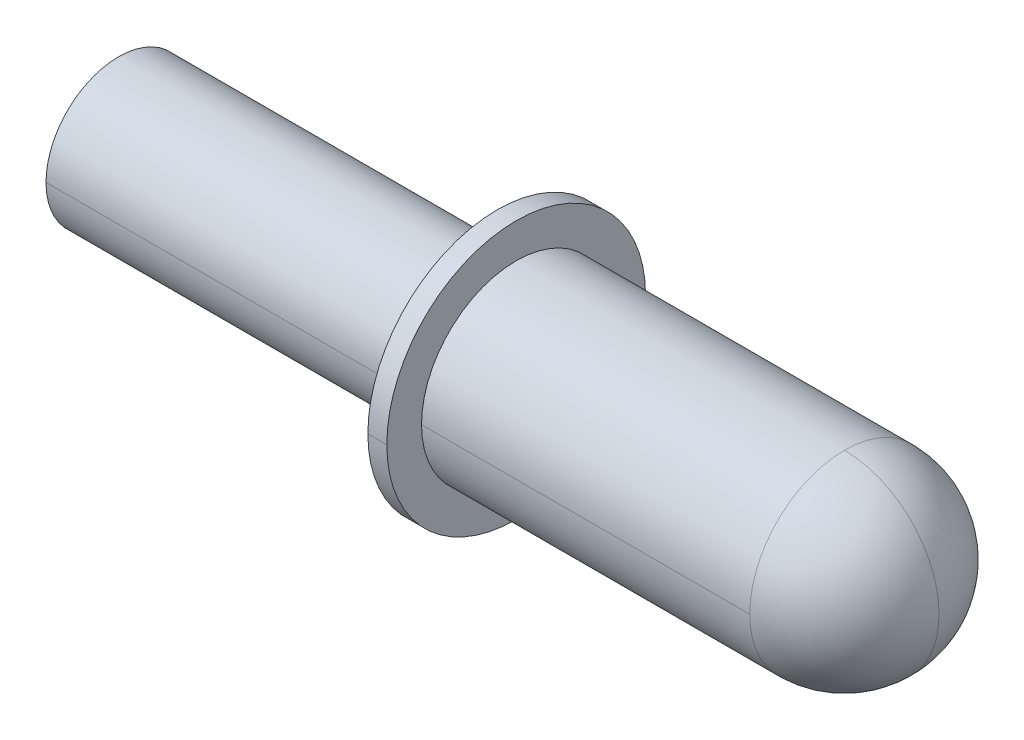
ISO-10303-21;
HEADER;
FILE_DESCRIPTION(('STEP AP214'),'2;1');
FILE_NAME('part.step','',(''),(''),'','','');
FILE_SCHEMA(('AUTOMOTIVE_DESIGN { 1 0 10303 214 1 1 1 1 }'));
ENDSEC;
DATA;
#1=APPLICATION_CONTEXT('core data for automotive mechanical design processes');
#2=APPLICATION_PROTOCOL_DEFINITION('international standard','automotive_design',2000,#1);
#3=PRODUCT_CONTEXT('',#1,'mechanical');
#4=PRODUCT('Part','Part','',(#3));
#5=PRODUCT_RELATED_PRODUCT_CATEGORY('part','',(#4));
#6=PRODUCT_DEFINITION_FORMATION('','',#4);
#7=PRODUCT_DEFINITION_CONTEXT('part definition',#1,'design');
#8=PRODUCT_DEFINITION('design','',#6,#7);
#9=PRODUCT_DEFINITION_SHAPE('','',#8);
#10=(LENGTH_UNIT() NAMED_UNIT(*) SI_UNIT(.MILLI.,.METRE.));
#11=(NAMED_UNIT(*) PLANE_ANGLE_UNIT() SI_UNIT($,.RADIAN.));
#12=(NAMED_UNIT(*) SI_UNIT($,.STERADIAN.) SOLID_ANGLE_UNIT());
#13=UNCERTAINTY_MEASURE_WITH_UNIT(LENGTH_MEASURE(1.E-05),#10,'distance_accuracy_value','');
#14=(GEOMETRIC_REPRESENTATION_CONTEXT(3) GLOBAL_UNCERTAINTY_ASSIGNED_CONTEXT((#13)) GLOBAL_UNIT_ASSIGNED_CONTEXT((#10,
#11,#12)) REPRESENTATION_CONTEXT('',''));
#15=CARTESIAN_POINT('',(0.,0.,0.));
#16=DIRECTION('',(0.,0.,1.));
#17=DIRECTION('',(1.,0.,0.));
#18=AXIS2_PLACEMENT_3D('',#15,#16,#17);
#19=CARTESIAN_POINT('',(0.3,0.,0.));
#20=DIRECTION('',(-1.,0.,0.));
#21=DIRECTION('',(0.,-1.,0.));
#22=AXIS2_PLACEMENT_3D('',#19,#20,#21);
#23=CYLINDRICAL_SURFACE('',#22,2.05);
#24=CARTESIAN_POINT('',(0.3,0.,0.));
#25=DIRECTION('',(1.,0.,0.));
#26=DIRECTION('',(0.,0.,-1.));
#27=AXIS2_PLACEMENT_3D('',#24,#25,#26);
#28=CIRCLE('',#27,2.05);
#29=CARTESIAN_POINT('',(0.3,0.,-2.05));
#30=VERTEX_POINT('',#29);
#31=CARTESIAN_POINT('',(0.3,0.,2.05));
#32=VERTEX_POINT('',#31);
#33=EDGE_CURVE('E11',#30,#32,#28,.T.);
#34=ORIENTED_EDGE('',*,*,#33,.F.);
#35=DIRECTION('',(-1.,0.,0.));
#36=VECTOR('',#35,1.);
#37=CARTESIAN_POINT('',(0.3,0.,-2.05));
#38=LINE('',#37,#36);
#39=CARTESIAN_POINT('',(0.,0.,-2.05));
#40=VERTEX_POINT('',#39);
#41=EDGE_CURVE('E25',#30,#40,#38,.T.);
#42=ORIENTED_EDGE('',*,*,#41,.T.);
#43=CARTESIAN_POINT('',(0.,0.,0.));
#44=DIRECTION('',(1.,0.,0.));
#45=DIRECTION('',(0.,0.,-1.));
#46=AXIS2_PLACEMENT_3D('',#43,#44,#45);
#47=CIRCLE('',#46,2.05);
#48=CARTESIAN_POINT('',(0.,0.,2.05));
#49=VERTEX_POINT('',#48);
#50=EDGE_CURVE('E292',#40,#49,#47,.T.);
#51=ORIENTED_EDGE('',*,*,#50,.T.);
#52=DIRECTION('',(-1.,0.,0.));
#53=VECTOR('',#52,1.);
#54=CARTESIAN_POINT('',(0.3,0.,2.05));
#55=LINE('',#54,#53);
#56=EDGE_CURVE('E287',#32,#49,#55,.T.);
#57=ORIENTED_EDGE('',*,*,#56,.F.);
#58=EDGE_LOOP('',(#34,#42,#51,#57));
#59=FACE_BOUND('',#58,.T.);
#60=ADVANCED_FACE('F17',(#59),#23,.T.);
#61=CARTESIAN_POINT('',(0.3,0.,0.));
#62=DIRECTION('',(-1.,0.,0.));
#63=DIRECTION('',(0.,1.,0.));
#64=AXIS2_PLACEMENT_3D('',#61,#62,#63);
#65=CYLINDRICAL_SURFACE('',#64,2.05);
#66=CARTESIAN_POINT('',(0.,0.,0.));
#67=DIRECTION('',(1.,0.,0.));
#68=DIRECTION('',(0.,0.,-1.));
#69=AXIS2_PLACEMENT_3D('',#66,#67,#68);
#70=CIRCLE('',#69,2.05);
#71=EDGE_CURVE('E283',#49,#40,#70,.T.);
#72=ORIENTED_EDGE('',*,*,#71,.T.);
#73=ORIENTED_EDGE('',*,*,#41,.F.);
#74=CARTESIAN_POINT('',(0.3,0.,0.));
#75=DIRECTION('',(1.,0.,0.));
#76=DIRECTION('',(0.,0.,-1.));
#77=AXIS2_PLACEMENT_3D('',#74,#75,#76);
#78=CIRCLE('',#77,2.05);
#79=EDGE_CURVE('E278',#32,#30,#78,.T.);
#80=ORIENTED_EDGE('',*,*,#79,.F.);
#81=ORIENTED_EDGE('',*,*,#56,.T.);
#82=EDGE_LOOP('',(#72,#73,#80,#81));
#83=FACE_BOUND('',#82,.T.);
#84=ADVANCED_FACE('F305',(#83),#65,.T.);
#85=CARTESIAN_POINT('',(0.3,2.05,0.));
#86=DIRECTION('',(-1.,0.,0.));
#87=DIRECTION('',(0.,0.,1.));
#88=AXIS2_PLACEMENT_3D('',#85,#86,#87);
#89=PLANE('',#88);
#90=CARTESIAN_POINT('',(0.3,0.,0.));
#91=DIRECTION('',(-1.,0.,0.));
#92=DIRECTION('',(0.,0.,1.));
#93=AXIS2_PLACEMENT_3D('',#90,#91,#92);
#94=CIRCLE('',#93,1.5);
#95=CARTESIAN_POINT('',(0.3,0.,1.5));
#96=VERTEX_POINT('',#95);
#97=CARTESIAN_POINT('',(0.3,0.,-1.5));
#98=VERTEX_POINT('',#97);
#99=EDGE_CURVE('E274',#96,#98,#94,.T.);
#100=ORIENTED_EDGE('',*,*,#99,.T.);
#101=CARTESIAN_POINT('',(0.3,0.,0.));
#102=DIRECTION('',(-1.,0.,0.));
#103=DIRECTION('',(0.,0.,1.));
#104=AXIS2_PLACEMENT_3D('',#101,#102,#103);
#105=CIRCLE('',#104,1.5);
#106=EDGE_CURVE('E270',#98,#96,#105,.T.);
#107=ORIENTED_EDGE('',*,*,#106,.T.);
#108=EDGE_LOOP('',(#100,#107));
#109=FACE_BOUND('',#108,.T.);
#110=ORIENTED_EDGE('',*,*,#33,.T.);
#111=ORIENTED_EDGE('',*,*,#79,.T.);
#112=EDGE_LOOP('',(#110,#111));
#113=FACE_BOUND('',#112,.T.);
#114=ADVANCED_FACE('F347',(#109,#113),#89,.F.);
#115=CARTESIAN_POINT('',(7.,0.,0.));
#116=DIRECTION('',(-1.,0.,0.));
#117=DIRECTION('',(0.,1.,0.));
#118=AXIS2_PLACEMENT_3D('',#115,#116,#117);
#119=CYLINDRICAL_SURFACE('',#118,1.5);
#120=ORIENTED_EDGE('',*,*,#106,.F.);
#121=DIRECTION('',(-1.,0.,0.));
#122=VECTOR('',#121,1.);
#123=CARTESIAN_POINT('',(5.5,0.,-1.5));
#124=LINE('',#123,#122);
#125=CARTESIAN_POINT('',(5.5,0.,-1.5));
#126=VERTEX_POINT('',#125);
#127=EDGE_CURVE('E265',#126,#98,#124,.T.);
#128=ORIENTED_EDGE('',*,*,#127,.F.);
#129=CARTESIAN_POINT('',(5.5,0.,0.));
#130=DIRECTION('',(1.,0.,0.));
#131=DIRECTION('',(0.,0.,-1.));
#132=AXIS2_PLACEMENT_3D('',#129,#130,#131);
#133=CIRCLE('',#132,1.5);
#134=CARTESIAN_POINT('',(5.5,-1.50000000000007,0.));
#135=VERTEX_POINT('',#134);
#136=EDGE_CURVE('E261',#135,#126,#133,.T.);
#137=ORIENTED_EDGE('',*,*,#136,.F.);
#138=CARTESIAN_POINT('',(5.5,0.,0.));
#139=DIRECTION('',(1.,0.,0.));
#140=DIRECTION('',(0.,0.,-1.));
#141=AXIS2_PLACEMENT_3D('',#138,#139,#140);
#142=CIRCLE('',#141,1.5);
#143=CARTESIAN_POINT('',(5.5,0.,1.5));
#144=VERTEX_POINT('',#143);
#145=EDGE_CURVE('E257',#144,#135,#142,.T.);
#146=ORIENTED_EDGE('',*,*,#145,.F.);
#147=DIRECTION('',(-1.,0.,0.));
#148=VECTOR('',#147,1.);
#149=CARTESIAN_POINT('',(5.5,0.,1.5));
#150=LINE('',#149,#148);
#151=EDGE_CURVE('E252',#144,#96,#150,.T.);
#152=ORIENTED_EDGE('',*,*,#151,.T.);
#153=EDGE_LOOP('',(#120,#128,#137,#146,#152));
#154=FACE_BOUND('',#153,.T.);
#155=ADVANCED_FACE('F351',(#154),#119,.T.);
#156=CARTESIAN_POINT('',(7.,0.,0.));
#157=DIRECTION('',(-1.,0.,0.));
#158=DIRECTION('',(0.,-1.,0.));
#159=AXIS2_PLACEMENT_3D('',#156,#157,#158);
#160=CYLINDRICAL_SURFACE('',#159,1.5);
#161=CARTESIAN_POINT('',(5.5,0.,0.));
#162=DIRECTION('',(1.,0.,0.));
#163=DIRECTION('',(0.,0.,-1.));
#164=AXIS2_PLACEMENT_3D('',#161,#162,#163);
#165=CIRCLE('',#164,1.5);
#166=CARTESIAN_POINT('',(5.5,1.49999999999993,0.));
#167=VERTEX_POINT('',#166);
#168=EDGE_CURVE('E248',#167,#144,#165,.T.);
#169=ORIENTED_EDGE('',*,*,#168,.F.);
#170=CARTESIAN_POINT('',(5.5,0.,0.));
#171=DIRECTION('',(1.,0.,0.));
#172=DIRECTION('',(0.,0.,-1.));
#173=AXIS2_PLACEMENT_3D('',#170,#171,#172);
#174=CIRCLE('',#173,1.5);
#175=EDGE_CURVE('E246',#126,#167,#174,.T.);
#176=ORIENTED_EDGE('',*,*,#175,.F.);
#177=ORIENTED_EDGE('',*,*,#127,.T.);
#178=ORIENTED_EDGE('',*,*,#99,.F.);
#179=ORIENTED_EDGE('',*,*,#151,.F.);
#180=EDGE_LOOP('',(#169,#176,#177,#178,#179));
#181=FACE_BOUND('',#180,.T.);
#182=ADVANCED_FACE('F356',(#181),#160,.T.);
#183=CARTESIAN_POINT('',(5.49999999999993,0.,0.));
#184=DIRECTION('',(1.,0.,0.));
#185=DIRECTION('',(0.,0.,1.));
#186=AXIS2_PLACEMENT_3D('',#183,#184,#185);
#187=SPHERICAL_SURFACE('',#186,1.5);
#188=CARTESIAN_POINT('',(5.5,-1.50000000000007,0.));
#189=CARTESIAN_POINT('',(5.52454371739133,-1.50000052063323,0.));
#190=CARTESIAN_POINT('',(5.54908739048189,-1.4993976256878,0.));
#191=CARTESIAN_POINT('',(5.59811563250036,-1.49698874292786,0.));
#192=CARTESIAN_POINT('',(5.62260020142827,-1.49518275511335,0.));
#193=CARTESIAN_POINT('',(5.67145121956039,-1.49037142490338,0.));
#194=CARTESIAN_POINT('',(5.69581766876459,-1.48736608250791,0.));
#195=CARTESIAN_POINT('',(5.74437375460147,-1.48016344738656,0.));
#196=CARTESIAN_POINT('',(5.76856339123415,-1.47596615466067,0.));
#197=CARTESIAN_POINT('',(5.81670757481421,-1.46638968654914,0.));
#198=CARTESIAN_POINT('',(5.84066212176159,-1.4610105111635,0.));
#199=CARTESIAN_POINT('',(5.88827841794817,-1.44908324842025,0.));
#200=CARTESIAN_POINT('',(5.91194016718736,-1.44253516106262,0.));
#201=CARTESIAN_POINT('',(5.95891386457599,-1.42828584613412,0.));
#202=CARTESIAN_POINT('',(5.98222581272544,-1.42058461856323,0.));
#203=CARTESIAN_POINT('',(6.02844374745118,-1.40404757698594,0.));
#204=CARTESIAN_POINT('',(6.05134973402746,-1.39521176297955,0.));
#205=CARTESIAN_POINT('',(6.09670056306776,-1.37642683455442,0.));
#206=CARTESIAN_POINT('',(6.11914540553176,-1.3664777201357,0.));
#207=CARTESIAN_POINT('',(6.16351987475903,-1.34549015923474,0.));
#208=CARTESIAN_POINT('',(6.1854495015223,-1.3344517127525,0.));
#209=CARTESIAN_POINT('',(6.22874070895563,-1.31131208029267,0.));
#210=CARTESIAN_POINT('',(6.25010228962569,-1.29921089431507,0.));
#211=CARTESIAN_POINT('',(6.29220594295391,-1.27397493568584,0.));
#212=CARTESIAN_POINT('',(6.31294801561208,-1.26084016303421,0.));
#213=CARTESIAN_POINT('',(6.35376268344665,-1.23356867387353,0.));
#214=CARTESIAN_POINT('',(6.37383527862305,-1.21943195736447,0.));
#215=CARTESIAN_POINT('',(6.41326263485417,-1.19019063707756,0.));
#216=CARTESIAN_POINT('',(6.43261739590888,-1.1750860332997,0.));
#217=CARTESIAN_POINT('',(6.47056245658197,-1.14394532678861,0.));
#218=CARTESIAN_POINT('',(6.48915275620034,-1.12790922405537,0.));
#219=CARTESIAN_POINT('',(6.52552410834063,-1.09494415200961,0.));
#220=CARTESIAN_POINT('',(6.54330516086255,-1.07801518269709,0.));
#221=CARTESIAN_POINT('',(6.57801518269699,-1.04330516086265,0.));
#222=CARTESIAN_POINT('',(6.59494415200951,-1.02552410834073,0.));
#223=CARTESIAN_POINT('',(6.62790922405527,-0.989152756200432,0.));
#224=CARTESIAN_POINT('',(6.6439453267885,-0.970562456582063,0.));
#225=CARTESIAN_POINT('',(6.6750860332996,-0.932617395908978,0.));
#226=CARTESIAN_POINT('',(6.69019063707746,-0.913262634854262,0.));
#227=CARTESIAN_POINT('',(6.71943195736437,-0.873835278623144,0.));
#228=CARTESIAN_POINT('',(6.73356867387342,-0.853762683446743,0.));
#229=CARTESIAN_POINT('',(6.7608401630341,-0.812948015612172,0.));
#230=CARTESIAN_POINT('',(6.77397493568574,-0.792205942954001,0.));
#231=CARTESIAN_POINT('',(6.79921089431496,-0.750102289625774,0.));
#232=CARTESIAN_POINT('',(6.81131208029256,-0.728740708955717,0.));
#233=CARTESIAN_POINT('',(6.83445171275239,-0.685449501522389,0.));
#234=CARTESIAN_POINT('',(6.84549015923462,-0.663519874759119,0.));
#235=CARTESIAN_POINT('',(6.86647772013558,-0.619145405531844,0.));
#236=CARTESIAN_POINT('',(6.87642683455431,-0.596700563067841,0.));
#237=CARTESIAN_POINT('',(6.89521176297943,-0.551349734027549,0.));
#238=CARTESIAN_POINT('',(6.90404757698582,-0.52844374745126,0.));
#239=CARTESIAN_POINT('',(6.92058461856311,-0.482225812725524,0.));
#240=CARTESIAN_POINT('',(6.92828584613399,-0.458913864576076,0.));
#241=CARTESIAN_POINT('',(6.9425351610625,-0.411940167187439,0.));
#242=CARTESIAN_POINT('',(6.94908324842012,-0.388278417948249,0.));
#243=CARTESIAN_POINT('',(6.96101051116338,-0.340662121761675,0.));
#244=CARTESIAN_POINT('',(6.96638968654901,-0.316707574814291,0.));
#245=CARTESIAN_POINT('',(6.97596615466054,-0.26856339123423,0.));
#246=CARTESIAN_POINT('',(6.98016344738643,-0.244373754601552,0.));
#247=CARTESIAN_POINT('',(6.98736608250778,-0.195817668764674,0.));
#248=CARTESIAN_POINT('',(6.99037142490324,-0.171451219560472,0.));
#249=CARTESIAN_POINT('',(6.99518275511321,-0.122600201428354,0.));
#250=CARTESIAN_POINT('',(6.99698874292772,-0.0981156325004374,0.));
#251=CARTESIAN_POINT('',(6.99939762568766,-0.049087390481966,0.));
#252=CARTESIAN_POINT('',(7.00000052063309,-0.0245437173914114,0.));
#253=CARTESIAN_POINT('',(6.99999999999993,0.,0.));
#254=B_SPLINE_CURVE_WITH_KNOTS('',3,(#188,#189,#190,#191,#192,#193,#194,#195,#196,#197,#198,
#199,#200,#201,#202,#203,#204,#205,#206,#207,#208,#209,#210,#211,#212,#213,#214,#215,#216,#217,
#218,#219,#220,#221,#222,#223,#224,#225,#226,#227,#228,#229,#230,#231,#232,#233,#234,#235,#236,
#237,#238,#239,#240,#241,#242,#243,#244,#245,#246,#247,#248,#249,#250,#251,#252,#253),
.UNSPECIFIED.,.F.,.F.,(4,2,2,2,2,2,2,2,2,2,2,2,2,2,2,2,2,2,2,2,2,2,2,2,2,2,2,2,2,2,2,2,4),(0.,
0.0736236855687349,0.14724737113747,0.220871056706204,0.294494742274939,0.368118427843673,
0.441742113412407,0.515365798981142,0.588989484549877,0.662613170118611,0.736236855687347,
0.809860541256081,0.883484226824816,0.957107912393551,1.03073159796228,1.10435528353102,
1.17797896909975,1.25160265466849,1.32522634023722,1.39885002580596,1.47247371137469,
1.54609739694343,1.61972108251216,1.6933447680809,1.76696845364963,1.84059213921837,
1.9142158247871,1.98783951035584,2.06146319592457,2.1350868814933,2.20871056706204,
2.28233425263077,2.35595793819951),.UNSPECIFIED.);
#255=CARTESIAN_POINT('',(6.99999999999993,0.,0.));
#256=VERTEX_POINT('',#255);
#257=EDGE_CURVE('E244',#135,#256,#254,.T.);
#258=ORIENTED_EDGE('',*,*,#257,.F.);
#259=ORIENTED_EDGE('',*,*,#136,.T.);
#260=ORIENTED_EDGE('',*,*,#175,.T.);
#261=CARTESIAN_POINT('',(5.5,1.49999999999993,0.));
#262=CARTESIAN_POINT('',(5.52454371739133,1.50000052063309,0.));
#263=CARTESIAN_POINT('',(5.54908739048189,1.49939762568765,0.));
#264=CARTESIAN_POINT('',(5.59811563250036,1.49698874292771,0.));
#265=CARTESIAN_POINT('',(5.62260020142827,1.4951827551132,0.));
#266=CARTESIAN_POINT('',(5.67145121956039,1.49037142490323,0.));
#267=CARTESIAN_POINT('',(5.69581766876459,1.48736608250777,0.));
#268=CARTESIAN_POINT('',(5.74437375460147,1.48016344738641,0.));
#269=CARTESIAN_POINT('',(5.76856339123415,1.47596615466052,0.));
#270=CARTESIAN_POINT('',(5.81670757481421,1.466389686549,0.));
#271=CARTESIAN_POINT('',(5.84066212176159,1.46101051116336,0.));
#272=CARTESIAN_POINT('',(5.88827841794817,1.4490832484201,0.));
#273=CARTESIAN_POINT('',(5.91194016718736,1.44253516106248,0.));
#274=CARTESIAN_POINT('',(5.95891386457599,1.42828584613397,0.));
#275=CARTESIAN_POINT('',(5.98222581272544,1.42058461856308,0.));
#276=CARTESIAN_POINT('',(6.02844374745117,1.4040475769858,0.));
#277=CARTESIAN_POINT('',(6.05134973402746,1.3952117629794,0.));
#278=CARTESIAN_POINT('',(6.09670056306775,1.37642683455428,0.));
#279=CARTESIAN_POINT('',(6.11914540553176,1.36647772013555,0.));
#280=CARTESIAN_POINT('',(6.16351987475903,1.34549015923459,0.));
#281=CARTESIAN_POINT('',(6.1854495015223,1.33445171275235,0.));
#282=CARTESIAN_POINT('',(6.22874070895563,1.31131208029252,0.));
#283=CARTESIAN_POINT('',(6.25010228962569,1.29921089431493,0.));
#284=CARTESIAN_POINT('',(6.29220594295391,1.2739749356857,0.));
#285=CARTESIAN_POINT('',(6.31294801561208,1.26084016303407,0.));
#286=CARTESIAN_POINT('',(6.35376268344665,1.23356867387338,0.));
#287=CARTESIAN_POINT('',(6.37383527862305,1.21943195736433,0.));
#288=CARTESIAN_POINT('',(6.41326263485417,1.19019063707742,0.));
#289=CARTESIAN_POINT('',(6.43261739590888,1.17508603329956,0.));
#290=CARTESIAN_POINT('',(6.47056245658197,1.14394532678846,0.));
#291=CARTESIAN_POINT('',(6.48915275620034,1.12790922405522,0.));
#292=CARTESIAN_POINT('',(6.52552410834063,1.09494415200947,0.));
#293=CARTESIAN_POINT('',(6.54330516086255,1.07801518269695,0.));
#294=CARTESIAN_POINT('',(6.57801518269699,1.04330516086251,0.));
#295=CARTESIAN_POINT('',(6.59494415200951,1.02552410834058,0.));
#296=CARTESIAN_POINT('',(6.62790922405526,0.989152756200287,0.));
#297=CARTESIAN_POINT('',(6.6439453267885,0.970562456581918,0.));
#298=CARTESIAN_POINT('',(6.6750860332996,0.932617395908833,0.));
#299=CARTESIAN_POINT('',(6.69019063707746,0.913262634854117,0.));
#300=CARTESIAN_POINT('',(6.71943195736437,0.873835278622999,0.));
#301=CARTESIAN_POINT('',(6.73356867387342,0.853762683446598,0.));
#302=CARTESIAN_POINT('',(6.7608401630341,0.812948015612027,0.));
#303=CARTESIAN_POINT('',(6.77397493568573,0.792205942953856,0.));
#304=CARTESIAN_POINT('',(6.79921089431496,0.750102289625629,0.));
#305=CARTESIAN_POINT('',(6.81131208029256,0.728740708955572,0.));
#306=CARTESIAN_POINT('',(6.83445171275238,0.685449501522245,0.));
#307=CARTESIAN_POINT('',(6.84549015923462,0.663519874758974,0.));
#308=CARTESIAN_POINT('',(6.86647772013558,0.6191454055317,0.));
#309=CARTESIAN_POINT('',(6.87642683455431,0.596700563067696,0.));
#310=CARTESIAN_POINT('',(6.89521176297943,0.551349734027404,0.));
#311=CARTESIAN_POINT('',(6.90404757698582,0.528443747451115,0.));
#312=CARTESIAN_POINT('',(6.92058461856311,0.482225812725379,0.));
#313=CARTESIAN_POINT('',(6.92828584613399,0.458913864575932,0.));
#314=CARTESIAN_POINT('',(6.9425351610625,0.411940167187294,0.));
#315=CARTESIAN_POINT('',(6.94908324842012,0.388278417948104,0.));
#316=CARTESIAN_POINT('',(6.96101051116338,0.34066212176153,0.));
#317=CARTESIAN_POINT('',(6.96638968654901,0.316707574814146,0.));
#318=CARTESIAN_POINT('',(6.97596615466054,0.268563391234085,0.));
#319=CARTESIAN_POINT('',(6.98016344738643,0.244373754601407,0.));
#320=CARTESIAN_POINT('',(6.98736608250778,0.195817668764529,0.));
#321=CARTESIAN_POINT('',(6.99037142490324,0.171451219560328,0.));
#322=CARTESIAN_POINT('',(6.99518275511321,0.12260020142821,0.));
#323=CARTESIAN_POINT('',(6.99698874292772,0.0981156325002929,0.));
#324=CARTESIAN_POINT('',(6.99939762568766,0.0490873904818212,0.));
#325=CARTESIAN_POINT('',(7.00000052063309,0.0245437173912666,0.));
#326=CARTESIAN_POINT('',(6.99999999999993,0.,0.));
#327=B_SPLINE_CURVE_WITH_KNOTS('',3,(#261,#262,#263,#264,#265,#266,#267,#268,#269,#270,#271,
#272,#273,#274,#275,#276,#277,#278,#279,#280,#281,#282,#283,#284,#285,#286,#287,#288,#289,#290,
#291,#292,#293,#294,#295,#296,#297,#298,#299,#300,#301,#302,#303,#304,#305,#306,#307,#308,#309,
#310,#311,#312,#313,#314,#315,#316,#317,#318,#319,#320,#321,#322,#323,#324,#325,#326),
.UNSPECIFIED.,.F.,.F.,(4,2,2,2,2,2,2,2,2,2,2,2,2,2,2,2,2,2,2,2,2,2,2,2,2,2,2,2,2,2,2,2,4),(0.,
0.0736236855687341,0.147247371137469,0.220871056706204,0.294494742274938,0.368118427843673,
0.441742113412407,0.515365798981142,0.588989484549877,0.662613170118611,0.736236855687346,
0.809860541256081,0.883484226824816,0.95710791239355,1.03073159796228,1.10435528353102,
1.17797896909975,1.25160265466849,1.32522634023722,1.39885002580596,1.47247371137469,
1.54609739694343,1.61972108251216,1.6933447680809,1.76696845364963,1.84059213921837,
1.9142158247871,1.98783951035583,2.06146319592457,2.1350868814933,2.20871056706204,
2.28233425263077,2.35595793819951),.UNSPECIFIED.);
#328=EDGE_CURVE('E185',#167,#256,#327,.T.);
#329=ORIENTED_EDGE('',*,*,#328,.T.);
#330=EDGE_LOOP('',(#258,#259,#260,#329));
#331=FACE_BOUND('',#330,.T.);
#332=ADVANCED_FACE('F205',(#331),#187,.T.);
#333=CARTESIAN_POINT('',(5.49999999999993,0.,0.));
#334=DIRECTION('',(1.,0.,0.));
#335=DIRECTION('',(0.,0.,-1.));
#336=AXIS2_PLACEMENT_3D('',#333,#334,#335);
#337=SPHERICAL_SURFACE('',#336,1.5);
#338=ORIENTED_EDGE('',*,*,#328,.F.);
#339=ORIENTED_EDGE('',*,*,#168,.T.);
#340=ORIENTED_EDGE('',*,*,#145,.T.);
#341=ORIENTED_EDGE('',*,*,#257,.T.);
#342=EDGE_LOOP('',(#338,#339,#340,#341));
#343=FACE_BOUND('',#342,.T.);
#344=ADVANCED_FACE('F194',(#343),#337,.T.);
#345=CARTESIAN_POINT('',(0.,1.15,0.));
#346=DIRECTION('',(1.,0.,0.));
#347=DIRECTION('',(0.,0.,-1.));
#348=AXIS2_PLACEMENT_3D('',#345,#346,#347);
#349=PLANE('',#348);
#350=ORIENTED_EDGE('',*,*,#50,.F.);
#351=ORIENTED_EDGE('',*,*,#71,.F.);
#352=EDGE_LOOP('',(#350,#351));
#353=FACE_BOUND('',#352,.T.);
#354=CARTESIAN_POINT('',(0.,0.,0.));
#355=DIRECTION('',(1.,0.,0.));
#356=DIRECTION('',(0.,0.,-1.));
#357=AXIS2_PLACEMENT_3D('',#354,#355,#356);
#358=CIRCLE('',#357,1.15);
#359=CARTESIAN_POINT('',(0.,0.,-1.15));
#360=VERTEX_POINT('',#359);
#361=CARTESIAN_POINT('',(0.,0.,1.15));
#362=VERTEX_POINT('',#361);
#363=EDGE_CURVE('E181',#360,#362,#358,.T.);
#364=ORIENTED_EDGE('',*,*,#363,.T.);
#365=CARTESIAN_POINT('',(0.,0.,0.));
#366=DIRECTION('',(1.,0.,0.));
#367=DIRECTION('',(0.,0.,-1.));
#368=AXIS2_PLACEMENT_3D('',#365,#366,#367);
#369=CIRCLE('',#368,1.15);
#370=EDGE_CURVE('E177',#362,#360,#369,.T.);
#371=ORIENTED_EDGE('',*,*,#370,.T.);
#372=EDGE_LOOP('',(#364,#371));
#373=FACE_BOUND('',#372,.T.);
#374=ADVANCED_FACE('F204',(#353,#373),#349,.F.);
#375=CARTESIAN_POINT('',(7.,0.,0.));
#376=DIRECTION('',(-1.,0.,0.));
#377=DIRECTION('',(0.,1.,0.));
#378=AXIS2_PLACEMENT_3D('',#375,#376,#377);
#379=CYLINDRICAL_SURFACE('',#378,1.15);
#380=CARTESIAN_POINT('',(-6.,0.,0.));
#381=DIRECTION('',(1.,0.,0.));
#382=DIRECTION('',(0.,0.,-1.));
#383=AXIS2_PLACEMENT_3D('',#380,#381,#382);
#384=CIRCLE('',#383,1.15);
#385=CARTESIAN_POINT('',(-6.,0.,1.15));
#386=VERTEX_POINT('',#385);
#387=CARTESIAN_POINT('',(-6.,0.,-1.15));
#388=VERTEX_POINT('',#387);
#389=EDGE_CURVE('E173',#386,#388,#384,.T.);
#390=ORIENTED_EDGE('',*,*,#389,.T.);
#391=DIRECTION('',(-1.,0.,0.));
#392=VECTOR('',#391,1.);
#393=CARTESIAN_POINT('',(0.,0.,-1.15));
#394=LINE('',#393,#392);
#395=EDGE_CURVE('E168',#360,#388,#394,.T.);
#396=ORIENTED_EDGE('',*,*,#395,.F.);
#397=ORIENTED_EDGE('',*,*,#370,.F.);
#398=DIRECTION('',(-1.,0.,0.));
#399=VECTOR('',#398,1.);
#400=CARTESIAN_POINT('',(0.,0.,1.15));
#401=LINE('',#400,#399);
#402=EDGE_CURVE('E164',#362,#386,#401,.T.);
#403=ORIENTED_EDGE('',*,*,#402,.T.);
#404=EDGE_LOOP('',(#390,#396,#397,#403));
#405=FACE_BOUND('',#404,.T.);
#406=ADVANCED_FACE('F308',(#405),#379,.T.);
#407=CARTESIAN_POINT('',(7.,0.,0.));
#408=DIRECTION('',(-1.,0.,0.));
#409=DIRECTION('',(0.,-1.,0.));
#410=AXIS2_PLACEMENT_3D('',#407,#408,#409);
#411=CYLINDRICAL_SURFACE('',#410,1.15);
#412=ORIENTED_EDGE('',*,*,#363,.F.);
#413=ORIENTED_EDGE('',*,*,#395,.T.);
#414=CARTESIAN_POINT('',(-6.,0.,0.));
#415=DIRECTION('',(1.,0.,0.));
#416=DIRECTION('',(0.,0.,-1.));
#417=AXIS2_PLACEMENT_3D('',#414,#415,#416);
#418=CIRCLE('',#417,1.15);
#419=EDGE_CURVE('E159',#388,#386,#418,.T.);
#420=ORIENTED_EDGE('',*,*,#419,.T.);
#421=ORIENTED_EDGE('',*,*,#402,.F.);
#422=EDGE_LOOP('',(#412,#413,#420,#421));
#423=FACE_BOUND('',#422,.T.);
#424=ADVANCED_FACE('F315',(#423),#411,.T.);
#425=CARTESIAN_POINT('',(-6.,0.85,0.));
#426=DIRECTION('',(1.,0.,0.));
#427=DIRECTION('',(0.,0.,-1.));
#428=AXIS2_PLACEMENT_3D('',#425,#426,#427);
#429=PLANE('',#428);
#430=ORIENTED_EDGE('',*,*,#419,.F.);
#431=ORIENTED_EDGE('',*,*,#389,.F.);
#432=EDGE_LOOP('',(#430,#431));
#433=FACE_BOUND('',#432,.T.);
#434=CARTESIAN_POINT('',(-6.,0.,0.));
#435=DIRECTION('',(1.,0.,0.));
#436=DIRECTION('',(0.,0.,-1.));
#437=AXIS2_PLACEMENT_3D('',#434,#435,#436);
#438=CIRCLE('',#437,0.85);
#439=CARTESIAN_POINT('',(-6.,0.,-0.85));
#440=VERTEX_POINT('',#439);
#441=CARTESIAN_POINT('',(-6.,0.,0.85));
#442=VERTEX_POINT('',#441);
#443=EDGE_CURVE('E155',#440,#442,#438,.T.);
#444=ORIENTED_EDGE('',*,*,#443,.T.);
#445=CARTESIAN_POINT('',(-6.,0.,0.));
#446=DIRECTION('',(1.,0.,0.));
#447=DIRECTION('',(0.,0.,-1.));
#448=AXIS2_PLACEMENT_3D('',#445,#446,#447);
#449=CIRCLE('',#448,0.85);
#450=EDGE_CURVE('E151',#442,#440,#449,.T.);
#451=ORIENTED_EDGE('',*,*,#450,.T.);
#452=EDGE_LOOP('',(#444,#451));
#453=FACE_BOUND('',#452,.T.);
#454=ADVANCED_FACE('F319',(#433,#453),#429,.F.);
#455=CARTESIAN_POINT('',(7.,0.,0.));
#456=DIRECTION('',(-1.,0.,0.));
#457=DIRECTION('',(0.,1.,0.));
#458=AXIS2_PLACEMENT_3D('',#455,#456,#457);
#459=CYLINDRICAL_SURFACE('',#458,0.85);
#460=ORIENTED_EDGE('',*,*,#450,.F.);
#461=DIRECTION('',(-1.,0.,0.));
#462=VECTOR('',#461,1.);
#463=CARTESIAN_POINT('',(0.,0.,0.85));
#464=LINE('',#463,#462);
#465=CARTESIAN_POINT('',(0.,0.,0.85));
#466=VERTEX_POINT('',#465);
#467=EDGE_CURVE('E146',#466,#442,#464,.T.);
#468=ORIENTED_EDGE('',*,*,#467,.F.);
#469=CARTESIAN_POINT('',(0.,0.,0.));
#470=DIRECTION('',(1.,0.,0.));
#471=DIRECTION('',(0.,0.,-1.));
#472=AXIS2_PLACEMENT_3D('',#469,#470,#471);
#473=CIRCLE('',#472,0.85);
#474=CARTESIAN_POINT('',(0.,0.,-0.85));
#475=VERTEX_POINT('',#474);
#476=EDGE_CURVE('E142',#466,#475,#473,.T.);
#477=ORIENTED_EDGE('',*,*,#476,.T.);
#478=DIRECTION('',(-1.,0.,0.));
#479=VECTOR('',#478,1.);
#480=CARTESIAN_POINT('',(0.,0.,-0.85));
#481=LINE('',#480,#479);
#482=EDGE_CURVE('E137',#475,#440,#481,.T.);
#483=ORIENTED_EDGE('',*,*,#482,.T.);
#484=EDGE_LOOP('',(#460,#468,#477,#483));
#485=FACE_BOUND('',#484,.T.);
#486=ADVANCED_FACE('F322',(#485),#459,.F.);
#487=CARTESIAN_POINT('',(7.,0.,0.));
#488=DIRECTION('',(-1.,0.,0.));
#489=DIRECTION('',(0.,-1.,0.));
#490=AXIS2_PLACEMENT_3D('',#487,#488,#489);
#491=CYLINDRICAL_SURFACE('',#490,0.85);
#492=CARTESIAN_POINT('',(0.,0.,0.));
#493=DIRECTION('',(1.,0.,0.));
#494=DIRECTION('',(0.,0.,-1.));
#495=AXIS2_PLACEMENT_3D('',#492,#493,#494);
#496=CIRCLE('',#495,0.85);
#497=EDGE_CURVE('E132',#475,#466,#496,.T.);
#498=ORIENTED_EDGE('',*,*,#497,.T.);
#499=ORIENTED_EDGE('',*,*,#467,.T.);
#500=ORIENTED_EDGE('',*,*,#443,.F.);
#501=ORIENTED_EDGE('',*,*,#482,.F.);
#502=EDGE_LOOP('',(#498,#499,#500,#501));
#503=FACE_BOUND('',#502,.T.);
#504=ADVANCED_FACE('F329',(#503),#491,.F.);
#505=CARTESIAN_POINT('',(0.,0.,0.));
#506=DIRECTION('',(1.,0.,0.));
#507=DIRECTION('',(0.,0.,-1.));
#508=AXIS2_PLACEMENT_3D('',#505,#506,#507);
#509=PLANE('',#508);
#510=ORIENTED_EDGE('',*,*,#497,.F.);
#511=ORIENTED_EDGE('',*,*,#476,.F.);
#512=EDGE_LOOP('',(#510,#511));
#513=FACE_BOUND('',#512,.T.);
#514=ADVANCED_FACE('F333',(#513),#509,.F.);
#515=CLOSED_SHELL('',(#60,#84,#114,#155,#182,#332,#344,#374,#406,#424,#454,#486,#504,#514));
#516=CARTESIAN_POINT('',(0.3,2.05,0.));
#517=DIRECTION('',(-1.,0.,0.));
#518=DIRECTION('',(0.,0.,1.));
#519=AXIS2_PLACEMENT_3D('',#516,#517,#518);
#520=PLANE('',#519);
#521=CARTESIAN_POINT('',(0.3,0.,0.));
#522=DIRECTION('',(-1.,0.,0.));
#523=DIRECTION('',(0.,0.,1.));
#524=AXIS2_PLACEMENT_3D('',#521,#522,#523);
#525=CIRCLE('',#524,0.85);
#526=CARTESIAN_POINT('',(0.3,0.,0.85));
#527=VERTEX_POINT('',#526);
#528=CARTESIAN_POINT('',(0.3,0.,-0.85));
#529=VERTEX_POINT('',#528);
#530=EDGE_CURVE('E113',#527,#529,#525,.T.);
#531=ORIENTED_EDGE('',*,*,#530,.F.);
#532=CARTESIAN_POINT('',(0.3,0.,0.));
#533=DIRECTION('',(-1.,0.,0.));
#534=DIRECTION('',(0.,0.,1.));
#535=AXIS2_PLACEMENT_3D('',#532,#533,#534);
#536=CIRCLE('',#535,0.85);
#537=EDGE_CURVE('E125',#529,#527,#536,.T.);
#538=ORIENTED_EDGE('',*,*,#537,.F.);
#539=EDGE_LOOP('',(#531,#538));
#540=FACE_BOUND('',#539,.T.);
#541=ADVANCED_FACE('F418',(#540),#520,.F.);
#542=CARTESIAN_POINT('',(7.,0.,0.));
#543=DIRECTION('',(-1.,0.,0.));
#544=DIRECTION('',(0.,1.,0.));
#545=AXIS2_PLACEMENT_3D('',#542,#543,#544);
#546=CYLINDRICAL_SURFACE('',#545,0.85);
#547=ORIENTED_EDGE('',*,*,#537,.T.);
#548=DIRECTION('',(-1.,0.,0.));
#549=VECTOR('',#548,1.);
#550=CARTESIAN_POINT('',(6.,0.,0.85));
#551=LINE('',#550,#549);
#552=CARTESIAN_POINT('',(6.,0.,0.85));
#553=VERTEX_POINT('',#552);
#554=EDGE_CURVE('E105',#553,#527,#551,.T.);
#555=ORIENTED_EDGE('',*,*,#554,.F.);
#556=CARTESIAN_POINT('',(6.,0.,0.));
#557=DIRECTION('',(1.,0.,0.));
#558=DIRECTION('',(0.,0.,-1.));
#559=AXIS2_PLACEMENT_3D('',#556,#557,#558);
#560=CIRCLE('',#559,0.85);
#561=CARTESIAN_POINT('',(6.,0.,-0.85));
#562=VERTEX_POINT('',#561);
#563=EDGE_CURVE('E98',#553,#562,#560,.T.);
#564=ORIENTED_EDGE('',*,*,#563,.T.);
#565=DIRECTION('',(-1.,0.,0.));
#566=VECTOR('',#565,1.);
#567=CARTESIAN_POINT('',(6.,0.,-0.85));
#568=LINE('',#567,#566);
#569=EDGE_CURVE('E102',#562,#529,#568,.T.);
#570=ORIENTED_EDGE('',*,*,#569,.T.);
#571=EDGE_LOOP('',(#547,#555,#564,#570));
#572=FACE_BOUND('',#571,.T.);
#573=ADVANCED_FACE('F101',(#572),#546,.F.);
#574=CARTESIAN_POINT('',(7.,0.,0.));
#575=DIRECTION('',(-1.,0.,0.));
#576=DIRECTION('',(0.,-1.,0.));
#577=AXIS2_PLACEMENT_3D('',#574,#575,#576);
#578=CYLINDRICAL_SURFACE('',#577,0.85);
#579=CARTESIAN_POINT('',(6.,0.,0.));
#580=DIRECTION('',(1.,0.,0.));
#581=DIRECTION('',(0.,0.,-1.));
#582=AXIS2_PLACEMENT_3D('',#579,#580,#581);
#583=CIRCLE('',#582,0.85);
#584=EDGE_CURVE('E112',#562,#553,#583,.T.);
#585=ORIENTED_EDGE('',*,*,#584,.T.);
#586=ORIENTED_EDGE('',*,*,#554,.T.);
#587=ORIENTED_EDGE('',*,*,#530,.T.);
#588=ORIENTED_EDGE('',*,*,#569,.F.);
#589=EDGE_LOOP('',(#585,#586,#587,#588));
#590=FACE_BOUND('',#589,.T.);
#591=ADVANCED_FACE('F111',(#590),#578,.F.);
#592=CARTESIAN_POINT('',(6.,0.,0.));
#593=DIRECTION('',(1.,0.,0.));
#594=DIRECTION('',(0.,0.,-1.));
#595=AXIS2_PLACEMENT_3D('',#592,#593,#594);
#596=PLANE('',#595);
#597=ORIENTED_EDGE('',*,*,#584,.F.);
#598=ORIENTED_EDGE('',*,*,#563,.F.);
#599=EDGE_LOOP('',(#597,#598));
#600=FACE_BOUND('',#599,.T.);
#601=ADVANCED_FACE('F115',(#600),#596,.F.);
#602=CLOSED_SHELL('',(#541,#573,#591,#601));
#603=ORIENTED_CLOSED_SHELL('',*,#602,.T.);
#604=BREP_WITH_VOIDS('B1',#515,(#603));
#605=ADVANCED_BREP_SHAPE_REPRESENTATION('',(#18,#604),#14);
#606=SHAPE_DEFINITION_REPRESENTATION(#9,#605);
ENDSEC;
END-ISO-10303-21;
